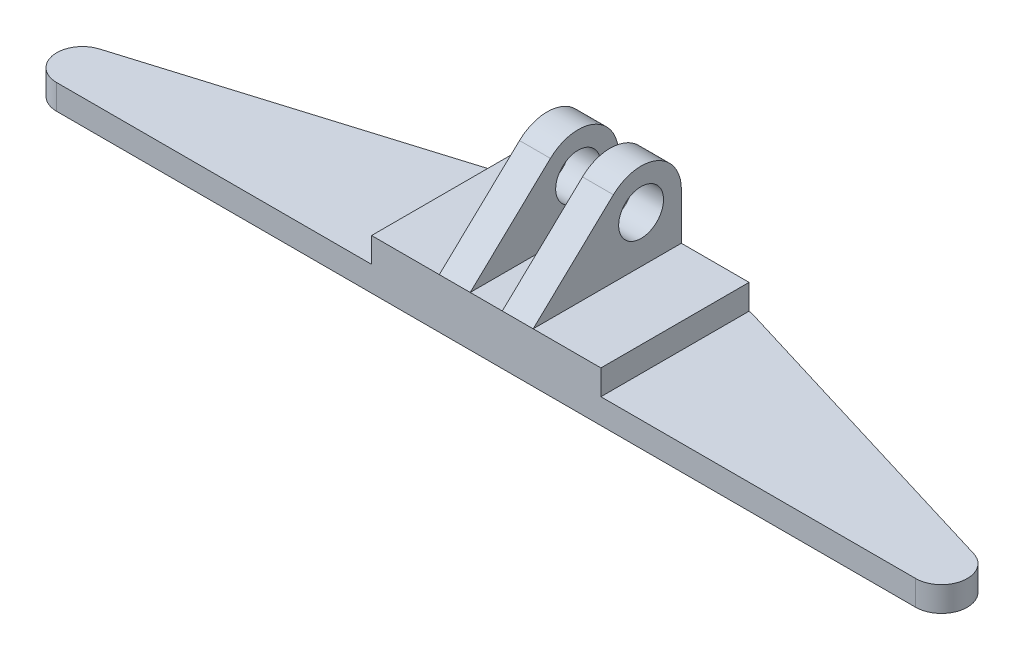
ISO-10303-21;
HEADER;
FILE_DESCRIPTION(('STEP AP214'),'2;1');
FILE_NAME('part.step','',(''),(''),'','','');
FILE_SCHEMA(('AUTOMOTIVE_DESIGN { 1 0 10303 214 1 1 1 1 }'));
ENDSEC;
DATA;
#1=APPLICATION_CONTEXT('core data for automotive mechanical design processes');
#2=APPLICATION_PROTOCOL_DEFINITION('international standard','automotive_design',2000,#1);
#3=PRODUCT_CONTEXT('',#1,'mechanical');
#4=PRODUCT('Part','Part','',(#3));
#5=PRODUCT_RELATED_PRODUCT_CATEGORY('part','',(#4));
#6=PRODUCT_DEFINITION_FORMATION('','',#4);
#7=PRODUCT_DEFINITION_CONTEXT('part definition',#1,'design');
#8=PRODUCT_DEFINITION('design','',#6,#7);
#9=PRODUCT_DEFINITION_SHAPE('','',#8);
#10=(LENGTH_UNIT() NAMED_UNIT(*) SI_UNIT(.MILLI.,.METRE.));
#11=(NAMED_UNIT(*) PLANE_ANGLE_UNIT() SI_UNIT($,.RADIAN.));
#12=(NAMED_UNIT(*) SI_UNIT($,.STERADIAN.) SOLID_ANGLE_UNIT());
#13=UNCERTAINTY_MEASURE_WITH_UNIT(LENGTH_MEASURE(1.E-05),#10,'distance_accuracy_value','');
#14=(GEOMETRIC_REPRESENTATION_CONTEXT(3) GLOBAL_UNCERTAINTY_ASSIGNED_CONTEXT((#13)) GLOBAL_UNIT_ASSIGNED_CONTEXT((#10,
#11,#12)) REPRESENTATION_CONTEXT('',''));
#15=CARTESIAN_POINT('',(0.,0.,0.));
#16=DIRECTION('',(0.,0.,1.));
#17=DIRECTION('',(1.,0.,0.));
#18=AXIS2_PLACEMENT_3D('',#15,#16,#17);
#19=CARTESIAN_POINT('',(205.64527986074,13.843,0.));
#20=DIRECTION('',(0.,0.725812494015296,0.687892595927079));
#21=DIRECTION('',(0.,-0.687892595927079,0.725812494015296));
#22=AXIS2_PLACEMENT_3D('',#19,#20,#21);
#23=PLANE('',#22);
#24=DIRECTION('',(0.,-0.687892595927079,0.725812494015296));
#25=VECTOR('',#24,1.);
#26=CARTESIAN_POINT('',(121.781863171167,13.843,0.));
#27=LINE('',#26,#25);
#28=CARTESIAN_POINT('',(121.781863171167,34.912162614441,-22.2305946517592));
#29=VERTEX_POINT('',#28);
#30=CARTESIAN_POINT('',(121.781863171167,13.843,0.));
#31=VERTEX_POINT('',#30);
#32=EDGE_CURVE('E178',#29,#31,#27,.T.);
#33=ORIENTED_EDGE('',*,*,#32,.F.);
#34=DIRECTION('',(-1.,0.,0.));
#35=VECTOR('',#34,1.);
#36=CARTESIAN_POINT('',(205.64527986074,34.912162614441,-22.2305946517592));
#37=LINE('',#36,#35);
#38=CARTESIAN_POINT('',(113.215713171167,34.912162614441,-22.2305946517592));
#39=VERTEX_POINT('',#38);
#40=EDGE_CURVE('E57',#29,#39,#37,.T.);
#41=ORIENTED_EDGE('',*,*,#40,.T.);
#42=DIRECTION('',(0.,0.687892595927079,-0.725812494015296));
#43=VECTOR('',#42,1.);
#44=CARTESIAN_POINT('',(113.215713171167,13.843,0.));
#45=LINE('',#44,#43);
#46=CARTESIAN_POINT('',(113.215713171167,13.843,0.));
#47=VERTEX_POINT('',#46);
#48=EDGE_CURVE('E204',#47,#39,#45,.T.);
#49=ORIENTED_EDGE('',*,*,#48,.F.);
#50=DIRECTION('',(1.,0.,0.));
#51=VECTOR('',#50,1.);
#52=CARTESIAN_POINT('',(94.4451131711667,13.843,0.));
#53=LINE('',#52,#51);
#54=EDGE_CURVE('E200',#47,#31,#53,.T.);
#55=ORIENTED_EDGE('',*,*,#54,.T.);
#56=EDGE_LOOP('',(#33,#41,#49,#55));
#57=FACE_BOUND('',#56,.T.);
#58=ADVANCED_FACE('F34',(#57),#23,.T.);
#59=CARTESIAN_POINT('',(205.64527986074,26.8097,-29.9097460678719));
#60=DIRECTION('',(-1.,0.,0.));
#61=DIRECTION('',(0.,0.,1.));
#62=AXIS2_PLACEMENT_3D('',#59,#60,#61);
#63=CYLINDRICAL_SURFACE('',#62,11.1633);
#64=CARTESIAN_POINT('',(121.781863171167,26.8097,-29.9097460678719));
#65=DIRECTION('',(-1.,0.,0.));
#66=DIRECTION('',(0.,0.,1.));
#67=AXIS2_PLACEMENT_3D('',#64,#65,#66);
#68=CIRCLE('',#67,11.1633);
#69=CARTESIAN_POINT('',(121.781863171167,26.8097,-41.0730460678719));
#70=VERTEX_POINT('',#69);
#71=EDGE_CURVE('E184',#70,#29,#68,.F.);
#72=ORIENTED_EDGE('',*,*,#71,.F.);
#73=DIRECTION('',(-1.,0.,0.));
#74=VECTOR('',#73,1.);
#75=CARTESIAN_POINT('',(205.64527986074,26.8097,-41.0730460678719));
#76=LINE('',#75,#74);
#77=CARTESIAN_POINT('',(113.215713171167,26.8097,-41.0730460678719));
#78=VERTEX_POINT('',#77);
#79=EDGE_CURVE('E257',#70,#78,#76,.T.);
#80=ORIENTED_EDGE('',*,*,#79,.T.);
#81=CARTESIAN_POINT('',(113.215713171167,26.8097,-29.9097460678719));
#82=DIRECTION('',(-1.,0.,0.));
#83=DIRECTION('',(0.,0.,1.));
#84=AXIS2_PLACEMENT_3D('',#81,#82,#83);
#85=CIRCLE('',#84,11.1633);
#86=EDGE_CURVE('E422',#39,#78,#85,.T.);
#87=ORIENTED_EDGE('',*,*,#86,.F.);
#88=ORIENTED_EDGE('',*,*,#40,.F.);
#89=EDGE_LOOP('',(#72,#80,#87,#88));
#90=FACE_BOUND('',#89,.T.);
#91=ADVANCED_FACE('F456',(#90),#63,.T.);
#92=CARTESIAN_POINT('',(205.64527986074,26.8097,-29.9097460678719));
#93=DIRECTION('',(-1.,0.,0.));
#94=DIRECTION('',(0.,0.,1.));
#95=AXIS2_PLACEMENT_3D('',#92,#93,#94);
#96=CYLINDRICAL_SURFACE('',#95,6.223);
#97=CARTESIAN_POINT('',(121.781863171167,26.8097,-29.9097460678719));
#98=DIRECTION('',(-1.,0.,0.));
#99=DIRECTION('',(0.,0.,1.));
#100=AXIS2_PLACEMENT_3D('',#97,#98,#99);
#101=CIRCLE('',#100,6.223);
#102=CARTESIAN_POINT('',(121.781863171167,26.8097,-23.6867460678719));
#103=VERTEX_POINT('',#102);
#104=EDGE_CURVE('E186',#103,#103,#101,.F.);
#105=ORIENTED_EDGE('',*,*,#104,.T.);
#106=EDGE_LOOP('',(#105));
#107=FACE_BOUND('',#106,.T.);
#108=CARTESIAN_POINT('',(113.215713171167,26.8097,-29.9097460678719));
#109=DIRECTION('',(-1.,0.,0.));
#110=DIRECTION('',(0.,0.,1.));
#111=AXIS2_PLACEMENT_3D('',#108,#109,#110);
#112=CIRCLE('',#111,6.223);
#113=CARTESIAN_POINT('',(113.215713171167,26.8097,-23.6867460678719));
#114=VERTEX_POINT('',#113);
#115=EDGE_CURVE('E425',#114,#114,#112,.T.);
#116=ORIENTED_EDGE('',*,*,#115,.T.);
#117=EDGE_LOOP('',(#116));
#118=FACE_BOUND('',#117,.T.);
#119=ADVANCED_FACE('F448',(#107,#118),#96,.F.);
#120=DIRECTION('',(0.,0.687892595927079,-0.725812494015296));
#121=VECTOR('',#120,1.);
#122=CARTESIAN_POINT('',(130.671863171167,13.843,0.));
#123=LINE('',#122,#121);
#124=CARTESIAN_POINT('',(130.671863171167,13.843,0.));
#125=VERTEX_POINT('',#124);
#126=CARTESIAN_POINT('',(130.671863171167,34.912162614441,-22.2305946517592));
#127=VERTEX_POINT('',#126);
#128=EDGE_CURVE('E286',#125,#127,#123,.T.);
#129=ORIENTED_EDGE('',*,*,#128,.F.);
#130=CARTESIAN_POINT('',(139.238013171167,13.843,0.));
#131=VERTEX_POINT('',#130);
#132=EDGE_CURVE('E202',#125,#131,#53,.T.);
#133=ORIENTED_EDGE('',*,*,#132,.T.);
#134=DIRECTION('',(0.,-0.687892595927079,0.725812494015296));
#135=VECTOR('',#134,1.);
#136=CARTESIAN_POINT('',(139.238013171167,13.843,0.));
#137=LINE('',#136,#135);
#138=CARTESIAN_POINT('',(139.238013171167,34.912162614441,-22.2305946517592));
#139=VERTEX_POINT('',#138);
#140=EDGE_CURVE('E274',#139,#131,#137,.T.);
#141=ORIENTED_EDGE('',*,*,#140,.F.);
#142=EDGE_CURVE('E259',#139,#127,#37,.T.);
#143=ORIENTED_EDGE('',*,*,#142,.T.);
#144=EDGE_LOOP('',(#129,#133,#141,#143));
#145=FACE_BOUND('',#144,.T.);
#146=ADVANCED_FACE('F285',(#145),#23,.T.);
#147=CARTESIAN_POINT('',(139.238013171167,26.8097,-41.0730460678719));
#148=VERTEX_POINT('',#147);
#149=CARTESIAN_POINT('',(130.671863171167,26.8097,-41.0730460678719));
#150=VERTEX_POINT('',#149);
#151=EDGE_CURVE('E247',#148,#150,#76,.T.);
#152=ORIENTED_EDGE('',*,*,#151,.T.);
#153=CARTESIAN_POINT('',(130.671863171167,26.8097,-29.9097460678719));
#154=DIRECTION('',(1.,0.,0.));
#155=DIRECTION('',(0.,0.,-1.));
#156=AXIS2_PLACEMENT_3D('',#153,#154,#155);
#157=CIRCLE('',#156,11.1633);
#158=EDGE_CURVE('E254',#127,#150,#157,.F.);
#159=ORIENTED_EDGE('',*,*,#158,.F.);
#160=ORIENTED_EDGE('',*,*,#142,.F.);
#161=CARTESIAN_POINT('',(139.238013171167,26.8097,-29.9097460678719));
#162=DIRECTION('',(-1.,0.,0.));
#163=DIRECTION('',(0.,0.,1.));
#164=AXIS2_PLACEMENT_3D('',#161,#162,#163);
#165=CIRCLE('',#164,11.1633);
#166=EDGE_CURVE('E256',#148,#139,#165,.F.);
#167=ORIENTED_EDGE('',*,*,#166,.F.);
#168=EDGE_LOOP('',(#152,#159,#160,#167));
#169=FACE_BOUND('',#168,.T.);
#170=ADVANCED_FACE('F252',(#169),#63,.T.);
#171=CARTESIAN_POINT('',(130.671863171167,26.8097,-29.9097460678719));
#172=DIRECTION('',(1.,0.,0.));
#173=DIRECTION('',(0.,0.,-1.));
#174=AXIS2_PLACEMENT_3D('',#171,#172,#173);
#175=CIRCLE('',#174,6.223);
#176=CARTESIAN_POINT('',(130.671863171167,26.8097,-36.1327460678719));
#177=VERTEX_POINT('',#176);
#178=EDGE_CURVE('E434',#177,#177,#175,.F.);
#179=ORIENTED_EDGE('',*,*,#178,.T.);
#180=EDGE_LOOP('',(#179));
#181=FACE_BOUND('',#180,.T.);
#182=CARTESIAN_POINT('',(139.238013171167,26.8097,-29.9097460678719));
#183=DIRECTION('',(-1.,0.,0.));
#184=DIRECTION('',(0.,0.,1.));
#185=AXIS2_PLACEMENT_3D('',#182,#183,#184);
#186=CIRCLE('',#185,6.223);
#187=CARTESIAN_POINT('',(139.238013171167,26.8097,-23.6867460678719));
#188=VERTEX_POINT('',#187);
#189=EDGE_CURVE('E263',#188,#188,#186,.F.);
#190=ORIENTED_EDGE('',*,*,#189,.T.);
#191=EDGE_LOOP('',(#190));
#192=FACE_BOUND('',#191,.T.);
#193=ADVANCED_FACE('F445',(#181,#192),#96,.F.);
#194=CARTESIAN_POINT('',(7.15645,6.9215,-7.15645));
#195=DIRECTION('',(0.,1.,0.));
#196=DIRECTION('',(0.,0.,1.));
#197=AXIS2_PLACEMENT_3D('',#194,#195,#196);
#198=PLANE('',#197);
#199=DIRECTION('',(0.,0.,1.));
#200=VECTOR('',#199,1.);
#201=CARTESIAN_POINT('',(94.4451131711667,6.9215,-41.0730460678719));
#202=LINE('',#201,#200);
#203=CARTESIAN_POINT('',(94.4451131711666,6.9215,-41.0730460678719));
#204=VERTEX_POINT('',#203);
#205=CARTESIAN_POINT('',(94.4451131711667,6.9215,0.));
#206=VERTEX_POINT('',#205);
#207=EDGE_CURVE('E265',#204,#206,#202,.T.);
#208=ORIENTED_EDGE('',*,*,#207,.F.);
#209=CARTESIAN_POINT('',(96.3152897362887,6.9215,-28.5115));
#210=DIRECTION('',(0.,1.,0.));
#211=DIRECTION('',(0.,0.,1.));
#212=AXIS2_PLACEMENT_3D('',#209,#210,#211);
#213=CIRCLE('',#212,12.7);
#214=CARTESIAN_POINT('',(92.6157135035588,6.9215,-40.6607030890186));
#215=VERTEX_POINT('',#214);
#216=EDGE_CURVE('E238',#204,#215,#213,.T.);
#217=ORIENTED_EDGE('',*,*,#216,.T.);
#218=DIRECTION('',(-0.956630164489657,0.,0.291305215175582));
#219=VECTOR('',#218,1.);
#220=CARTESIAN_POINT('',(5.0717387928567,6.9215,-14.002525940662));
#221=LINE('',#220,#219);
#222=CARTESIAN_POINT('',(5.0717387928567,6.9215,-14.002525940662));
#223=VERTEX_POINT('',#222);
#224=EDGE_CURVE('E325',#215,#223,#221,.T.);
#225=ORIENTED_EDGE('',*,*,#224,.T.);
#226=CARTESIAN_POINT('',(7.15645,6.9215,-7.15645));
#227=DIRECTION('',(0.,1.,0.));
#228=DIRECTION('',(0.,0.,1.));
#229=AXIS2_PLACEMENT_3D('',#226,#227,#228);
#230=CIRCLE('',#229,7.15645);
#231=CARTESIAN_POINT('',(7.15645,6.9215,0.));
#232=VERTEX_POINT('',#231);
#233=EDGE_CURVE('E312',#223,#232,#230,.T.);
#234=ORIENTED_EDGE('',*,*,#233,.T.);
#235=DIRECTION('',(1.,0.,0.));
#236=VECTOR('',#235,1.);
#237=CARTESIAN_POINT('',(7.15645,6.9215,0.));
#238=LINE('',#237,#236);
#239=EDGE_CURVE('E316',#232,#206,#238,.T.);
#240=ORIENTED_EDGE('',*,*,#239,.T.);
#241=EDGE_LOOP('',(#208,#217,#225,#234,#240));
#242=FACE_BOUND('',#241,.T.);
#243=ADVANCED_FACE('F404',(#242),#198,.T.);
#244=DIRECTION('',(-1.,0.,0.));
#245=VECTOR('',#244,1.);
#246=CARTESIAN_POINT('',(94.4451131711667,6.9215,-41.0730460678719));
#247=LINE('',#246,#245);
#248=CARTESIAN_POINT('',(157.967386828833,6.9215,-41.0730460678719));
#249=VERTEX_POINT('',#248);
#250=EDGE_CURVE('E218',#249,#204,#247,.T.);
#251=ORIENTED_EDGE('',*,*,#250,.F.);
#252=CARTESIAN_POINT('',(156.097210263711,6.9215,-28.5115));
#253=DIRECTION('',(0.,1.,0.));
#254=DIRECTION('',(0.,0.,1.));
#255=AXIS2_PLACEMENT_3D('',#252,#253,#254);
#256=CIRCLE('',#255,12.7);
#257=CARTESIAN_POINT('',(156.097210263711,6.9215,-41.2115));
#258=VERTEX_POINT('',#257);
#259=EDGE_CURVE('E362',#249,#258,#256,.T.);
#260=ORIENTED_EDGE('',*,*,#259,.T.);
#261=DIRECTION('',(-1.,0.,0.));
#262=VECTOR('',#261,1.);
#263=CARTESIAN_POINT('',(94.4245,6.9215,-41.2115));
#264=LINE('',#263,#262);
#265=CARTESIAN_POINT('',(96.3152897362887,6.9215,-41.2115));
#266=VERTEX_POINT('',#265);
#267=EDGE_CURVE('E322',#258,#266,#264,.T.);
#268=ORIENTED_EDGE('',*,*,#267,.T.);
#269=EDGE_CURVE('E230',#266,#204,#213,.T.);
#270=ORIENTED_EDGE('',*,*,#269,.T.);
#271=EDGE_LOOP('',(#251,#260,#268,#270));
#272=FACE_BOUND('',#271,.T.);
#273=ADVANCED_FACE('F372',(#272),#198,.T.);
#274=CARTESIAN_POINT('',(7.15645,6.9215,-7.15645));
#275=DIRECTION('',(0.,-1.,0.));
#276=DIRECTION('',(0.,0.,-1.));
#277=AXIS2_PLACEMENT_3D('',#274,#275,#276);
#278=CYLINDRICAL_SURFACE('',#277,7.15645);
#279=CARTESIAN_POINT('',(7.15645,0.,-7.15645));
#280=DIRECTION('',(0.,1.,0.));
#281=DIRECTION('',(0.,0.,1.));
#282=AXIS2_PLACEMENT_3D('',#279,#280,#281);
#283=CIRCLE('',#282,7.15645);
#284=CARTESIAN_POINT('',(5.0717387928567,0.,-14.002525940662));
#285=VERTEX_POINT('',#284);
#286=CARTESIAN_POINT('',(7.15645,0.,0.));
#287=VERTEX_POINT('',#286);
#288=EDGE_CURVE('E311',#285,#287,#283,.T.);
#289=ORIENTED_EDGE('',*,*,#288,.T.);
#290=DIRECTION('',(0.,-1.,0.));
#291=VECTOR('',#290,1.);
#292=CARTESIAN_POINT('',(7.15645,6.9215,0.));
#293=LINE('',#292,#291);
#294=EDGE_CURVE('E348',#232,#287,#293,.T.);
#295=ORIENTED_EDGE('',*,*,#294,.F.);
#296=ORIENTED_EDGE('',*,*,#233,.F.);
#297=DIRECTION('',(0.,-1.,0.));
#298=VECTOR('',#297,1.);
#299=CARTESIAN_POINT('',(5.0717387928567,6.9215,-14.002525940662));
#300=LINE('',#299,#298);
#301=EDGE_CURVE('E327',#223,#285,#300,.T.);
#302=ORIENTED_EDGE('',*,*,#301,.T.);
#303=EDGE_LOOP('',(#289,#295,#296,#302));
#304=FACE_BOUND('',#303,.T.);
#305=ADVANCED_FACE('F394',(#304),#278,.T.);
#306=CARTESIAN_POINT('',(7.15645,6.9215,0.));
#307=DIRECTION('',(0.,0.,-1.));
#308=DIRECTION('',(-1.,0.,0.));
#309=AXIS2_PLACEMENT_3D('',#306,#307,#308);
#310=PLANE('',#309);
#311=DIRECTION('',(1.,0.,0.));
#312=VECTOR('',#311,1.);
#313=CARTESIAN_POINT('',(7.15645,0.,0.));
#314=LINE('',#313,#312);
#315=CARTESIAN_POINT('',(245.25605,0.,0.));
#316=VERTEX_POINT('',#315);
#317=EDGE_CURVE('E330',#287,#316,#314,.T.);
#318=ORIENTED_EDGE('',*,*,#317,.T.);
#319=DIRECTION('',(0.,-1.,0.));
#320=VECTOR('',#319,1.);
#321=CARTESIAN_POINT('',(245.25605,6.9215,0.));
#322=LINE('',#321,#320);
#323=CARTESIAN_POINT('',(245.25605,6.9215,0.));
#324=VERTEX_POINT('',#323);
#325=EDGE_CURVE('E345',#324,#316,#322,.T.);
#326=ORIENTED_EDGE('',*,*,#325,.F.);
#327=CARTESIAN_POINT('',(158.008613171167,6.9215,0.));
#328=VERTEX_POINT('',#327);
#329=EDGE_CURVE('E295',#328,#324,#238,.T.);
#330=ORIENTED_EDGE('',*,*,#329,.F.);
#331=DIRECTION('',(0.,-1.,0.));
#332=VECTOR('',#331,1.);
#333=CARTESIAN_POINT('',(158.008613171167,13.843,0.));
#334=LINE('',#333,#332);
#335=CARTESIAN_POINT('',(158.008613171167,13.843,0.));
#336=VERTEX_POINT('',#335);
#337=EDGE_CURVE('E292',#336,#328,#334,.T.);
#338=ORIENTED_EDGE('',*,*,#337,.F.);
#339=EDGE_CURVE('E207',#131,#336,#53,.T.);
#340=ORIENTED_EDGE('',*,*,#339,.F.);
#341=ORIENTED_EDGE('',*,*,#132,.F.);
#342=DIRECTION('',(1.,0.,0.));
#343=VECTOR('',#342,1.);
#344=CARTESIAN_POINT('',(121.781863171167,13.843,0.));
#345=LINE('',#344,#343);
#346=EDGE_CURVE('E190',#31,#125,#345,.T.);
#347=ORIENTED_EDGE('',*,*,#346,.F.);
#348=ORIENTED_EDGE('',*,*,#54,.F.);
#349=CARTESIAN_POINT('',(94.4451131711667,13.843,0.));
#350=VERTEX_POINT('',#349);
#351=EDGE_CURVE('E205',#350,#47,#53,.T.);
#352=ORIENTED_EDGE('',*,*,#351,.F.);
#353=DIRECTION('',(0.,-1.,0.));
#354=VECTOR('',#353,1.);
#355=CARTESIAN_POINT('',(94.4451131711667,13.843,0.));
#356=LINE('',#355,#354);
#357=EDGE_CURVE('E297',#350,#206,#356,.T.);
#358=ORIENTED_EDGE('',*,*,#357,.T.);
#359=ORIENTED_EDGE('',*,*,#239,.F.);
#360=ORIENTED_EDGE('',*,*,#294,.T.);
#361=EDGE_LOOP('',(#318,#326,#330,#338,#340,#341,#347,#348,#352,#358,#359,#360));
#362=FACE_BOUND('',#361,.T.);
#363=ADVANCED_FACE('F198',(#362),#310,.F.);
#364=CARTESIAN_POINT('',(245.25605,6.9215,-7.15645));
#365=DIRECTION('',(0.,-1.,0.));
#366=DIRECTION('',(0.,0.,-1.));
#367=AXIS2_PLACEMENT_3D('',#364,#365,#366);
#368=CYLINDRICAL_SURFACE('',#367,7.15645);
#369=CARTESIAN_POINT('',(245.25605,0.,-7.15645));
#370=DIRECTION('',(0.,1.,0.));
#371=DIRECTION('',(0.,0.,1.));
#372=AXIS2_PLACEMENT_3D('',#369,#370,#371);
#373=CIRCLE('',#372,7.15645);
#374=CARTESIAN_POINT('',(247.340761207143,0.,-14.002525940662));
#375=VERTEX_POINT('',#374);
#376=EDGE_CURVE('E332',#316,#375,#373,.T.);
#377=ORIENTED_EDGE('',*,*,#376,.T.);
#378=DIRECTION('',(0.,-1.,0.));
#379=VECTOR('',#378,1.);
#380=CARTESIAN_POINT('',(247.340761207143,6.9215,-14.002525940662));
#381=LINE('',#380,#379);
#382=CARTESIAN_POINT('',(247.340761207143,6.9215,-14.002525940662));
#383=VERTEX_POINT('',#382);
#384=EDGE_CURVE('E342',#383,#375,#381,.T.);
#385=ORIENTED_EDGE('',*,*,#384,.F.);
#386=CARTESIAN_POINT('',(245.25605,6.9215,-7.15645));
#387=DIRECTION('',(0.,1.,0.));
#388=DIRECTION('',(0.,0.,1.));
#389=AXIS2_PLACEMENT_3D('',#386,#387,#388);
#390=CIRCLE('',#389,7.15645);
#391=EDGE_CURVE('E318',#324,#383,#390,.T.);
#392=ORIENTED_EDGE('',*,*,#391,.F.);
#393=ORIENTED_EDGE('',*,*,#325,.T.);
#394=EDGE_LOOP('',(#377,#385,#392,#393));
#395=FACE_BOUND('',#394,.T.);
#396=ADVANCED_FACE('F389',(#395),#368,.T.);
#397=CARTESIAN_POINT('',(247.340761207143,6.9215,-14.002525940662));
#398=DIRECTION('',(-0.291305215175582,0.,0.956630164489657));
#399=DIRECTION('',(0.956630164489657,0.,0.291305215175582));
#400=AXIS2_PLACEMENT_3D('',#397,#398,#399);
#401=PLANE('',#400);
#402=DIRECTION('',(-0.956630164489657,0.,-0.291305215175582));
#403=VECTOR('',#402,1.);
#404=CARTESIAN_POINT('',(247.340761207143,0.,-14.002525940662));
#405=LINE('',#404,#403);
#406=CARTESIAN_POINT('',(159.796786496441,0.,-40.6607030890186));
#407=VERTEX_POINT('',#406);
#408=EDGE_CURVE('E334',#375,#407,#405,.T.);
#409=ORIENTED_EDGE('',*,*,#408,.T.);
#410=DIRECTION('',(0.,-1.,0.));
#411=VECTOR('',#410,1.);
#412=CARTESIAN_POINT('',(159.796786496441,6.9215,-40.6607030890186));
#413=LINE('',#412,#411);
#414=CARTESIAN_POINT('',(159.796786496441,6.9215,-40.6607030890186));
#415=VERTEX_POINT('',#414);
#416=EDGE_CURVE('E227',#407,#415,#413,.F.);
#417=ORIENTED_EDGE('',*,*,#416,.T.);
#418=DIRECTION('',(-0.956630164489657,0.,-0.291305215175582));
#419=VECTOR('',#418,1.);
#420=CARTESIAN_POINT('',(247.340761207143,6.9215,-14.002525940662));
#421=LINE('',#420,#419);
#422=EDGE_CURVE('E320',#383,#415,#421,.T.);
#423=ORIENTED_EDGE('',*,*,#422,.F.);
#424=ORIENTED_EDGE('',*,*,#384,.T.);
#425=EDGE_LOOP('',(#409,#417,#423,#424));
#426=FACE_BOUND('',#425,.T.);
#427=ADVANCED_FACE('F385',(#426),#401,.F.);
#428=CARTESIAN_POINT('',(94.4245,6.9215,-41.2115));
#429=DIRECTION('',(0.,0.,1.));
#430=DIRECTION('',(1.,0.,0.));
#431=AXIS2_PLACEMENT_3D('',#428,#429,#430);
#432=PLANE('',#431);
#433=DIRECTION('',(-1.,0.,0.));
#434=VECTOR('',#433,1.);
#435=CARTESIAN_POINT('',(94.4245,0.,-41.2115));
#436=LINE('',#435,#434);
#437=CARTESIAN_POINT('',(156.097210263711,0.,-41.2115));
#438=VERTEX_POINT('',#437);
#439=CARTESIAN_POINT('',(96.3152897362887,0.,-41.2115));
#440=VERTEX_POINT('',#439);
#441=EDGE_CURVE('E336',#438,#440,#436,.T.);
#442=ORIENTED_EDGE('',*,*,#441,.T.);
#443=DIRECTION('',(0.,-1.,0.));
#444=VECTOR('',#443,1.);
#445=CARTESIAN_POINT('',(96.3152897362887,6.9215,-41.2115));
#446=LINE('',#445,#444);
#447=EDGE_CURVE('E361',#440,#266,#446,.F.);
#448=ORIENTED_EDGE('',*,*,#447,.T.);
#449=ORIENTED_EDGE('',*,*,#267,.F.);
#450=DIRECTION('',(0.,-1.,0.));
#451=VECTOR('',#450,1.);
#452=CARTESIAN_POINT('',(156.097210263711,6.9215,-41.2115));
#453=LINE('',#452,#451);
#454=EDGE_CURVE('E358',#258,#438,#453,.T.);
#455=ORIENTED_EDGE('',*,*,#454,.T.);
#456=EDGE_LOOP('',(#442,#448,#449,#455));
#457=FACE_BOUND('',#456,.T.);
#458=ADVANCED_FACE('F377',(#457),#432,.F.);
#459=CARTESIAN_POINT('',(5.0717387928567,6.9215,-14.002525940662));
#460=DIRECTION('',(0.291305215175582,0.,0.956630164489657));
#461=DIRECTION('',(0.956630164489657,0.,-0.291305215175582));
#462=AXIS2_PLACEMENT_3D('',#459,#460,#461);
#463=PLANE('',#462);
#464=ORIENTED_EDGE('',*,*,#224,.F.);
#465=DIRECTION('',(0.,-1.,0.));
#466=VECTOR('',#465,1.);
#467=CARTESIAN_POINT('',(92.6157135035588,6.9215,-40.6607030890186));
#468=LINE('',#467,#466);
#469=CARTESIAN_POINT('',(92.6157135035588,0.,-40.6607030890186));
#470=VERTEX_POINT('',#469);
#471=EDGE_CURVE('E351',#215,#470,#468,.T.);
#472=ORIENTED_EDGE('',*,*,#471,.T.);
#473=DIRECTION('',(-0.956630164489657,0.,0.291305215175582));
#474=VECTOR('',#473,1.);
#475=CARTESIAN_POINT('',(5.0717387928567,0.,-14.002525940662));
#476=LINE('',#475,#474);
#477=EDGE_CURVE('E315',#470,#285,#476,.T.);
#478=ORIENTED_EDGE('',*,*,#477,.T.);
#479=ORIENTED_EDGE('',*,*,#301,.F.);
#480=EDGE_LOOP('',(#464,#472,#478,#479));
#481=FACE_BOUND('',#480,.T.);
#482=ADVANCED_FACE('F398',(#481),#463,.F.);
#483=DIRECTION('',(0.,0.,-1.));
#484=VECTOR('',#483,1.);
#485=CARTESIAN_POINT('',(158.008613171167,6.9215,-41.0730460678719));
#486=LINE('',#485,#484);
#487=CARTESIAN_POINT('',(158.008613171167,6.9215,-41.0668390605499));
#488=VERTEX_POINT('',#487);
#489=EDGE_CURVE('E216',#328,#488,#486,.T.);
#490=ORIENTED_EDGE('',*,*,#489,.F.);
#491=ORIENTED_EDGE('',*,*,#329,.T.);
#492=ORIENTED_EDGE('',*,*,#391,.T.);
#493=ORIENTED_EDGE('',*,*,#422,.T.);
#494=EDGE_CURVE('E363',#415,#488,#256,.T.);
#495=ORIENTED_EDGE('',*,*,#494,.T.);
#496=EDGE_LOOP('',(#490,#491,#492,#493,#495));
#497=FACE_BOUND('',#496,.T.);
#498=ADVANCED_FACE('F454',(#497),#198,.T.);
#499=CARTESIAN_POINT('',(7.15645,0.,-7.15645));
#500=DIRECTION('',(0.,1.,0.));
#501=DIRECTION('',(0.,0.,1.));
#502=AXIS2_PLACEMENT_3D('',#499,#500,#501);
#503=PLANE('',#502);
#504=ORIENTED_EDGE('',*,*,#477,.F.);
#505=CARTESIAN_POINT('',(96.3152897362887,0.,-28.5115));
#506=DIRECTION('',(0.,1.,0.));
#507=DIRECTION('',(0.,0.,1.));
#508=AXIS2_PLACEMENT_3D('',#505,#506,#507);
#509=CIRCLE('',#508,12.7);
#510=EDGE_CURVE('E356',#470,#440,#509,.F.);
#511=ORIENTED_EDGE('',*,*,#510,.T.);
#512=ORIENTED_EDGE('',*,*,#441,.F.);
#513=CARTESIAN_POINT('',(156.097210263711,0.,-28.5115));
#514=DIRECTION('',(0.,1.,0.));
#515=DIRECTION('',(0.,0.,1.));
#516=AXIS2_PLACEMENT_3D('',#513,#514,#515);
#517=CIRCLE('',#516,12.7);
#518=EDGE_CURVE('E354',#438,#407,#517,.F.);
#519=ORIENTED_EDGE('',*,*,#518,.T.);
#520=ORIENTED_EDGE('',*,*,#408,.F.);
#521=ORIENTED_EDGE('',*,*,#376,.F.);
#522=ORIENTED_EDGE('',*,*,#317,.F.);
#523=ORIENTED_EDGE('',*,*,#288,.F.);
#524=EDGE_LOOP('',(#504,#511,#512,#519,#520,#521,#522,#523));
#525=FACE_BOUND('',#524,.T.);
#526=ADVANCED_FACE('F383',(#525),#503,.F.);
#527=CARTESIAN_POINT('',(96.3152897362887,6.9215,-28.5115));
#528=DIRECTION('',(0.,-1.,0.));
#529=DIRECTION('',(0.,0.,-1.));
#530=AXIS2_PLACEMENT_3D('',#527,#528,#529);
#531=CYLINDRICAL_SURFACE('',#530,12.7);
#532=ORIENTED_EDGE('',*,*,#269,.F.);
#533=ORIENTED_EDGE('',*,*,#447,.F.);
#534=ORIENTED_EDGE('',*,*,#510,.F.);
#535=ORIENTED_EDGE('',*,*,#471,.F.);
#536=ORIENTED_EDGE('',*,*,#216,.F.);
#537=EDGE_LOOP('',(#532,#533,#534,#535,#536));
#538=FACE_BOUND('',#537,.T.);
#539=ADVANCED_FACE('F401',(#538),#531,.T.);
#540=CARTESIAN_POINT('',(156.097210263711,6.9215,-28.5115));
#541=DIRECTION('',(0.,-1.,0.));
#542=DIRECTION('',(0.,0.,-1.));
#543=AXIS2_PLACEMENT_3D('',#540,#541,#542);
#544=CYLINDRICAL_SURFACE('',#543,12.7);
#545=ORIENTED_EDGE('',*,*,#494,.F.);
#546=ORIENTED_EDGE('',*,*,#416,.F.);
#547=ORIENTED_EDGE('',*,*,#518,.F.);
#548=ORIENTED_EDGE('',*,*,#454,.F.);
#549=ORIENTED_EDGE('',*,*,#259,.F.);
#550=EDGE_CURVE('E364',#488,#249,#256,.T.);
#551=ORIENTED_EDGE('',*,*,#550,.F.);
#552=EDGE_LOOP('',(#545,#546,#547,#548,#549,#551));
#553=FACE_BOUND('',#552,.T.);
#554=ADVANCED_FACE('F36',(#553),#544,.T.);
#555=CARTESIAN_POINT('',(0.,6.9215,0.));
#556=DIRECTION('',(0.,1.,0.));
#557=DIRECTION('',(0.,0.,1.));
#558=AXIS2_PLACEMENT_3D('',#555,#556,#557);
#559=PLANE('',#558);
#560=CARTESIAN_POINT('',(158.008613171167,6.9215,-41.0730460678719));
#561=VERTEX_POINT('',#560);
#562=EDGE_CURVE('E224',#488,#561,#486,.T.);
#563=ORIENTED_EDGE('',*,*,#562,.F.);
#564=ORIENTED_EDGE('',*,*,#550,.T.);
#565=EDGE_CURVE('E211',#561,#249,#247,.T.);
#566=ORIENTED_EDGE('',*,*,#565,.F.);
#567=EDGE_LOOP('',(#563,#564,#566));
#568=FACE_BOUND('',#567,.T.);
#569=ADVANCED_FACE('F544',(#568),#559,.F.);
#570=CARTESIAN_POINT('',(94.4451131711667,13.843,-41.0730460678719));
#571=DIRECTION('',(1.,0.,0.));
#572=DIRECTION('',(0.,0.,-1.));
#573=AXIS2_PLACEMENT_3D('',#570,#571,#572);
#574=PLANE('',#573);
#575=ORIENTED_EDGE('',*,*,#357,.F.);
#576=DIRECTION('',(0.,0.,1.));
#577=VECTOR('',#576,1.);
#578=CARTESIAN_POINT('',(94.4451131711667,13.843,-41.0730460678719));
#579=LINE('',#578,#577);
#580=CARTESIAN_POINT('',(94.4451131711667,13.843,-41.0730460678719));
#581=VERTEX_POINT('',#580);
#582=EDGE_CURVE('E407',#581,#350,#579,.T.);
#583=ORIENTED_EDGE('',*,*,#582,.F.);
#584=DIRECTION('',(0.,-1.,0.));
#585=VECTOR('',#584,1.);
#586=CARTESIAN_POINT('',(94.4451131711667,13.843,-41.0730460678719));
#587=LINE('',#586,#585);
#588=EDGE_CURVE('E302',#581,#204,#587,.T.);
#589=ORIENTED_EDGE('',*,*,#588,.T.);
#590=ORIENTED_EDGE('',*,*,#207,.T.);
#591=EDGE_LOOP('',(#575,#583,#589,#590));
#592=FACE_BOUND('',#591,.T.);
#593=ADVANCED_FACE('F406',(#592),#574,.F.);
#594=CARTESIAN_POINT('',(158.008613171167,13.843,-41.0730460678719));
#595=DIRECTION('',(-1.,0.,0.));
#596=DIRECTION('',(0.,0.,1.));
#597=AXIS2_PLACEMENT_3D('',#594,#595,#596);
#598=PLANE('',#597);
#599=ORIENTED_EDGE('',*,*,#489,.T.);
#600=ORIENTED_EDGE('',*,*,#562,.T.);
#601=DIRECTION('',(0.,-1.,0.));
#602=VECTOR('',#601,1.);
#603=CARTESIAN_POINT('',(158.008613171167,13.843,-41.0730460678719));
#604=LINE('',#603,#602);
#605=CARTESIAN_POINT('',(158.008613171167,13.843,-41.0730460678719));
#606=VERTEX_POINT('',#605);
#607=EDGE_CURVE('E298',#606,#561,#604,.T.);
#608=ORIENTED_EDGE('',*,*,#607,.F.);
#609=DIRECTION('',(0.,0.,-1.));
#610=VECTOR('',#609,1.);
#611=CARTESIAN_POINT('',(158.008613171167,13.843,-41.0730460678719));
#612=LINE('',#611,#610);
#613=EDGE_CURVE('E208',#336,#606,#612,.T.);
#614=ORIENTED_EDGE('',*,*,#613,.F.);
#615=ORIENTED_EDGE('',*,*,#337,.T.);
#616=EDGE_LOOP('',(#599,#600,#608,#614,#615));
#617=FACE_BOUND('',#616,.T.);
#618=ADVANCED_FACE('F301',(#617),#598,.F.);
#619=CARTESIAN_POINT('',(94.4451131711667,13.843,-41.0730460678719));
#620=DIRECTION('',(0.,0.,1.));
#621=DIRECTION('',(1.,0.,0.));
#622=AXIS2_PLACEMENT_3D('',#619,#620,#621);
#623=PLANE('',#622);
#624=ORIENTED_EDGE('',*,*,#79,.F.);
#625=DIRECTION('',(0.,-1.,0.));
#626=VECTOR('',#625,1.);
#627=CARTESIAN_POINT('',(121.781863171167,13.843,-41.0730460678719));
#628=LINE('',#627,#626);
#629=CARTESIAN_POINT('',(121.781863171167,13.843,-41.0730460678719));
#630=VERTEX_POINT('',#629);
#631=EDGE_CURVE('E12',#70,#630,#628,.T.);
#632=ORIENTED_EDGE('',*,*,#631,.T.);
#633=DIRECTION('',(1.,0.,0.));
#634=VECTOR('',#633,1.);
#635=CARTESIAN_POINT('',(94.4451131711667,13.843,-41.0730460678719));
#636=LINE('',#635,#634);
#637=CARTESIAN_POINT('',(130.671863171167,13.843,-41.0730460678719));
#638=VERTEX_POINT('',#637);
#639=EDGE_CURVE('E193',#630,#638,#636,.T.);
#640=ORIENTED_EDGE('',*,*,#639,.T.);
#641=DIRECTION('',(0.,1.,0.));
#642=VECTOR('',#641,1.);
#643=CARTESIAN_POINT('',(130.671863171167,13.843,-41.0730460678719));
#644=LINE('',#643,#642);
#645=EDGE_CURVE('E42',#638,#150,#644,.T.);
#646=ORIENTED_EDGE('',*,*,#645,.T.);
#647=ORIENTED_EDGE('',*,*,#151,.F.);
#648=DIRECTION('',(0.,1.,0.));
#649=VECTOR('',#648,1.);
#650=CARTESIAN_POINT('',(139.238013171167,26.8097,-41.0730460678719));
#651=LINE('',#650,#649);
#652=CARTESIAN_POINT('',(139.238013171167,13.843,-41.0730460678719));
#653=VERTEX_POINT('',#652);
#654=EDGE_CURVE('E266',#653,#148,#651,.T.);
#655=ORIENTED_EDGE('',*,*,#654,.F.);
#656=DIRECTION('',(-1.,0.,0.));
#657=VECTOR('',#656,1.);
#658=CARTESIAN_POINT('',(94.4451131711667,13.843,-41.0730460678719));
#659=LINE('',#658,#657);
#660=EDGE_CURVE('E289',#606,#653,#659,.T.);
#661=ORIENTED_EDGE('',*,*,#660,.F.);
#662=ORIENTED_EDGE('',*,*,#607,.T.);
#663=ORIENTED_EDGE('',*,*,#565,.T.);
#664=ORIENTED_EDGE('',*,*,#250,.T.);
#665=ORIENTED_EDGE('',*,*,#588,.F.);
#666=DIRECTION('',(-1.,0.,0.));
#667=VECTOR('',#666,1.);
#668=CARTESIAN_POINT('',(113.215713171167,13.843,-41.0730460678719));
#669=LINE('',#668,#667);
#670=CARTESIAN_POINT('',(113.215713171167,13.843,-41.0730460678719));
#671=VERTEX_POINT('',#670);
#672=EDGE_CURVE('E261',#671,#581,#669,.T.);
#673=ORIENTED_EDGE('',*,*,#672,.F.);
#674=DIRECTION('',(0.,-1.,0.));
#675=VECTOR('',#674,1.);
#676=CARTESIAN_POINT('',(113.215713171167,26.8097,-41.0730460678719));
#677=LINE('',#676,#675);
#678=EDGE_CURVE('E418',#78,#671,#677,.T.);
#679=ORIENTED_EDGE('',*,*,#678,.F.);
#680=EDGE_LOOP('',(#624,#632,#640,#646,#647,#655,#661,#662,#663,#664,#665,#673,#679));
#681=FACE_BOUND('',#680,.T.);
#682=ADVANCED_FACE('F245',(#681),#623,.F.);
#683=CARTESIAN_POINT('',(0.,13.843,0.));
#684=DIRECTION('',(0.,1.,0.));
#685=DIRECTION('',(0.,0.,1.));
#686=AXIS2_PLACEMENT_3D('',#683,#684,#685);
#687=PLANE('',#686);
#688=DIRECTION('',(0.,0.,-1.));
#689=VECTOR('',#688,1.);
#690=CARTESIAN_POINT('',(139.238013171167,13.843,-41.0730460678719));
#691=LINE('',#690,#689);
#692=EDGE_CURVE('E278',#131,#653,#691,.T.);
#693=ORIENTED_EDGE('',*,*,#692,.F.);
#694=ORIENTED_EDGE('',*,*,#339,.T.);
#695=ORIENTED_EDGE('',*,*,#613,.T.);
#696=ORIENTED_EDGE('',*,*,#660,.T.);
#697=EDGE_LOOP('',(#693,#694,#695,#696));
#698=FACE_BOUND('',#697,.T.);
#699=ADVANCED_FACE('F287',(#698),#687,.T.);
#700=CARTESIAN_POINT('',(139.238013171167,13.843,-41.0730460678719));
#701=DIRECTION('',(-1.,0.,0.));
#702=DIRECTION('',(0.,0.,1.));
#703=AXIS2_PLACEMENT_3D('',#700,#701,#702);
#704=PLANE('',#703);
#705=ORIENTED_EDGE('',*,*,#166,.T.);
#706=ORIENTED_EDGE('',*,*,#140,.T.);
#707=ORIENTED_EDGE('',*,*,#692,.T.);
#708=ORIENTED_EDGE('',*,*,#654,.T.);
#709=EDGE_LOOP('',(#705,#706,#707,#708));
#710=FACE_BOUND('',#709,.T.);
#711=ORIENTED_EDGE('',*,*,#189,.F.);
#712=EDGE_LOOP('',(#711));
#713=FACE_BOUND('',#712,.T.);
#714=ADVANCED_FACE('F282',(#710,#713),#704,.F.);
#715=CARTESIAN_POINT('',(113.215713171167,13.843,-41.0730460678719));
#716=DIRECTION('',(0.,-1.,0.));
#717=DIRECTION('',(0.,0.,-1.));
#718=AXIS2_PLACEMENT_3D('',#715,#716,#717);
#719=PLANE('',#718);
#720=ORIENTED_EDGE('',*,*,#582,.T.);
#721=ORIENTED_EDGE('',*,*,#351,.T.);
#722=DIRECTION('',(0.,0.,1.));
#723=VECTOR('',#722,1.);
#724=CARTESIAN_POINT('',(113.215713171167,13.843,-41.0730460678719));
#725=LINE('',#724,#723);
#726=EDGE_CURVE('E411',#671,#47,#725,.T.);
#727=ORIENTED_EDGE('',*,*,#726,.F.);
#728=ORIENTED_EDGE('',*,*,#672,.T.);
#729=EDGE_LOOP('',(#720,#721,#727,#728));
#730=FACE_BOUND('',#729,.T.);
#731=ADVANCED_FACE('F410',(#730),#719,.F.);
#732=CARTESIAN_POINT('',(113.215713171167,26.8097,-29.9097460678719));
#733=DIRECTION('',(-1.,0.,0.));
#734=DIRECTION('',(0.,0.,1.));
#735=AXIS2_PLACEMENT_3D('',#732,#733,#734);
#736=PLANE('',#735);
#737=ORIENTED_EDGE('',*,*,#115,.F.);
#738=EDGE_LOOP('',(#737));
#739=FACE_BOUND('',#738,.T.);
#740=ORIENTED_EDGE('',*,*,#86,.T.);
#741=ORIENTED_EDGE('',*,*,#678,.T.);
#742=ORIENTED_EDGE('',*,*,#726,.T.);
#743=ORIENTED_EDGE('',*,*,#48,.T.);
#744=EDGE_LOOP('',(#740,#741,#742,#743));
#745=FACE_BOUND('',#744,.T.);
#746=ADVANCED_FACE('F415',(#739,#745),#736,.T.);
#747=CARTESIAN_POINT('',(121.781863171167,13.843,-41.2115));
#748=DIRECTION('',(-1.,0.,0.));
#749=DIRECTION('',(0.,0.,1.));
#750=AXIS2_PLACEMENT_3D('',#747,#748,#749);
#751=PLANE('',#750);
#752=ORIENTED_EDGE('',*,*,#32,.T.);
#753=DIRECTION('',(0.,0.,1.));
#754=VECTOR('',#753,1.);
#755=CARTESIAN_POINT('',(121.781863171167,13.843,-41.2115));
#756=LINE('',#755,#754);
#757=EDGE_CURVE('E183',#630,#31,#756,.T.);
#758=ORIENTED_EDGE('',*,*,#757,.F.);
#759=ORIENTED_EDGE('',*,*,#631,.F.);
#760=ORIENTED_EDGE('',*,*,#71,.T.);
#761=EDGE_LOOP('',(#752,#758,#759,#760));
#762=FACE_BOUND('',#761,.T.);
#763=ORIENTED_EDGE('',*,*,#104,.F.);
#764=EDGE_LOOP('',(#763));
#765=FACE_BOUND('',#764,.T.);
#766=ADVANCED_FACE('F180',(#762,#765),#751,.F.);
#767=CARTESIAN_POINT('',(130.671863171167,13.843,-41.2115));
#768=DIRECTION('',(1.,0.,0.));
#769=DIRECTION('',(0.,0.,-1.));
#770=AXIS2_PLACEMENT_3D('',#767,#768,#769);
#771=PLANE('',#770);
#772=ORIENTED_EDGE('',*,*,#128,.T.);
#773=ORIENTED_EDGE('',*,*,#158,.T.);
#774=ORIENTED_EDGE('',*,*,#645,.F.);
#775=DIRECTION('',(0.,0.,1.));
#776=VECTOR('',#775,1.);
#777=CARTESIAN_POINT('',(130.671863171167,13.843,-41.2115));
#778=LINE('',#777,#776);
#779=EDGE_CURVE('E49',#638,#125,#778,.T.);
#780=ORIENTED_EDGE('',*,*,#779,.T.);
#781=EDGE_LOOP('',(#772,#773,#774,#780));
#782=FACE_BOUND('',#781,.T.);
#783=ORIENTED_EDGE('',*,*,#178,.F.);
#784=EDGE_LOOP('',(#783));
#785=FACE_BOUND('',#784,.T.);
#786=ADVANCED_FACE('F439',(#782,#785),#771,.F.);
#787=CARTESIAN_POINT('',(121.781863171167,13.843,-41.2115));
#788=DIRECTION('',(0.,-1.,0.));
#789=DIRECTION('',(0.,0.,-1.));
#790=AXIS2_PLACEMENT_3D('',#787,#788,#789);
#791=PLANE('',#790);
#792=ORIENTED_EDGE('',*,*,#757,.T.);
#793=ORIENTED_EDGE('',*,*,#346,.T.);
#794=ORIENTED_EDGE('',*,*,#779,.F.);
#795=ORIENTED_EDGE('',*,*,#639,.F.);
#796=EDGE_LOOP('',(#792,#793,#794,#795));
#797=FACE_BOUND('',#796,.T.);
#798=ADVANCED_FACE('F189',(#797),#791,.F.);
#799=CLOSED_SHELL('',(#58,#91,#119,#146,#170,#193,#243,#273,#305,#363,#396,#427,#458,#482,#498,
#526,#539,#554,#569,#593,#618,#682,#699,#714,#731,#746,#766,#786,#798));
#800=MANIFOLD_SOLID_BREP('B2',#799);
#801=ADVANCED_BREP_SHAPE_REPRESENTATION('',(#18,#800),#14);
#802=SHAPE_DEFINITION_REPRESENTATION(#9,#801);
ENDSEC;
END-ISO-10303-21;
